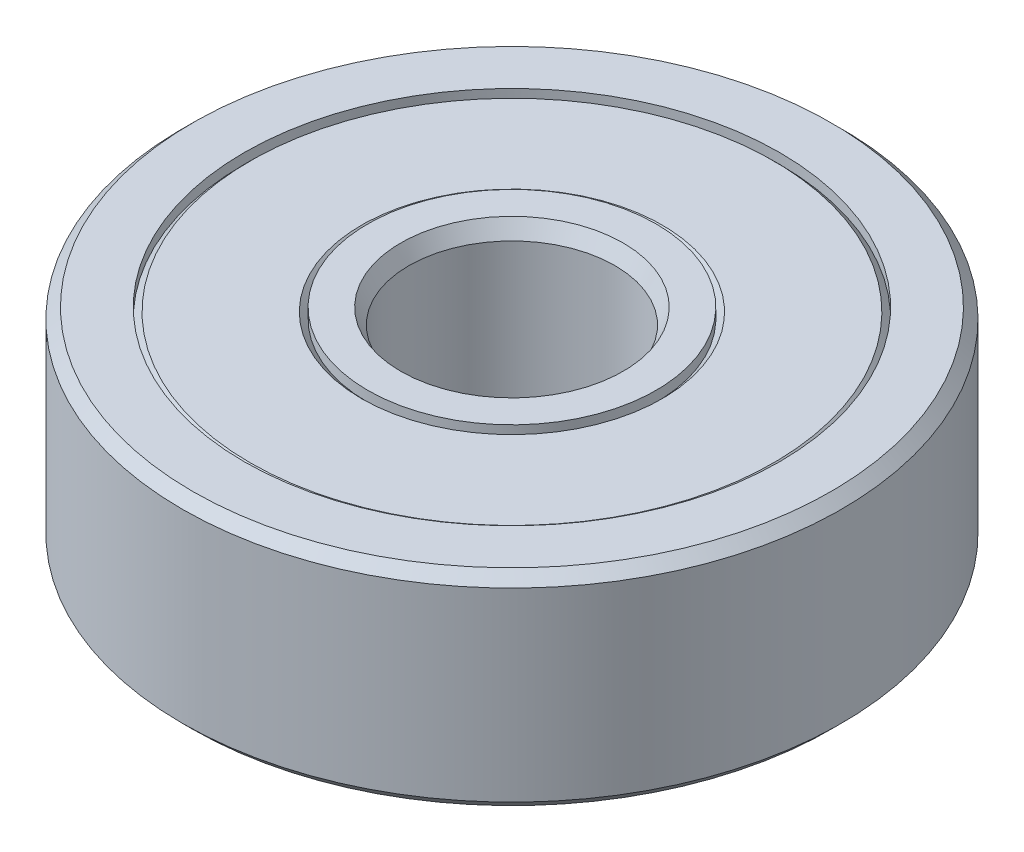
ISO-10303-21;
HEADER;
FILE_DESCRIPTION(('STEP AP214'),'2;1');
FILE_NAME('part.step','',(''),(''),'','','');
FILE_SCHEMA(('AUTOMOTIVE_DESIGN { 1 0 10303 214 1 1 1 1 }'));
ENDSEC;
DATA;
#1=APPLICATION_CONTEXT('core data for automotive mechanical design processes');
#2=APPLICATION_PROTOCOL_DEFINITION('international standard','automotive_design',2000,#1);
#3=PRODUCT_CONTEXT('',#1,'mechanical');
#4=PRODUCT('Part','Part','',(#3));
#5=PRODUCT_RELATED_PRODUCT_CATEGORY('part','',(#4));
#6=PRODUCT_DEFINITION_FORMATION('','',#4);
#7=PRODUCT_DEFINITION_CONTEXT('part definition',#1,'design');
#8=PRODUCT_DEFINITION('design','',#6,#7);
#9=PRODUCT_DEFINITION_SHAPE('','',#8);
#10=(LENGTH_UNIT() NAMED_UNIT(*) SI_UNIT(.MILLI.,.METRE.));
#11=(NAMED_UNIT(*) PLANE_ANGLE_UNIT() SI_UNIT($,.RADIAN.));
#12=(NAMED_UNIT(*) SI_UNIT($,.STERADIAN.) SOLID_ANGLE_UNIT());
#13=UNCERTAINTY_MEASURE_WITH_UNIT(LENGTH_MEASURE(1.E-05),#10,'distance_accuracy_value','');
#14=(GEOMETRIC_REPRESENTATION_CONTEXT(3) GLOBAL_UNCERTAINTY_ASSIGNED_CONTEXT((#13)) GLOBAL_UNIT_ASSIGNED_CONTEXT((#10,
#11,#12)) REPRESENTATION_CONTEXT('',''));
#15=CARTESIAN_POINT('',(0.,0.,0.));
#16=DIRECTION('',(0.,0.,1.));
#17=DIRECTION('',(1.,0.,0.));
#18=AXIS2_PLACEMENT_3D('',#15,#16,#17);
#19=CARTESIAN_POINT('',(0.,4.9,0.));
#20=DIRECTION('',(0.,-1.,0.));
#21=DIRECTION('',(0.,0.,-1.));
#22=AXIS2_PLACEMENT_3D('',#19,#20,#21);
#23=CYLINDRICAL_SURFACE('',#22,3.5);
#24=CARTESIAN_POINT('',(0.,0.250000000000004,0.));
#25=DIRECTION('',(0.,1.,0.));
#26=DIRECTION('',(0.,0.,1.));
#27=AXIS2_PLACEMENT_3D('',#24,#25,#26);
#28=CIRCLE('',#27,3.5);
#29=CARTESIAN_POINT('',(0.,0.250000000000004,3.5));
#30=VERTEX_POINT('',#29);
#31=EDGE_CURVE('E58',#30,#30,#28,.F.);
#32=ORIENTED_EDGE('',*,*,#31,.T.);
#33=EDGE_LOOP('',(#32));
#34=FACE_BOUND('',#33,.T.);
#35=CARTESIAN_POINT('',(0.,4.75,0.));
#36=DIRECTION('',(0.,1.,0.));
#37=DIRECTION('',(0.,0.,1.));
#38=AXIS2_PLACEMENT_3D('',#35,#36,#37);
#39=CIRCLE('',#38,3.5);
#40=CARTESIAN_POINT('',(0.,4.75,3.5));
#41=VERTEX_POINT('',#40);
#42=EDGE_CURVE('E62',#41,#41,#39,.T.);
#43=ORIENTED_EDGE('',*,*,#42,.T.);
#44=EDGE_LOOP('',(#43));
#45=FACE_BOUND('',#44,.T.);
#46=ADVANCED_FACE('F47',(#34,#45),#23,.F.);
#47=CARTESIAN_POINT('',(0.,4.9,0.));
#48=DIRECTION('',(0.,-1.,0.));
#49=DIRECTION('',(0.,0.,-1.));
#50=AXIS2_PLACEMENT_3D('',#47,#48,#49);
#51=CYLINDRICAL_SURFACE('',#50,6.5);
#52=CARTESIAN_POINT('',(0.,0.250000000000003,0.));
#53=DIRECTION('',(0.,1.,0.));
#54=DIRECTION('',(0.,0.,1.));
#55=AXIS2_PLACEMENT_3D('',#52,#53,#54);
#56=CIRCLE('',#55,6.5);
#57=CARTESIAN_POINT('',(0.,0.250000000000003,6.5));
#58=VERTEX_POINT('',#57);
#59=EDGE_CURVE('E73',#58,#58,#56,.T.);
#60=ORIENTED_EDGE('',*,*,#59,.T.);
#61=EDGE_LOOP('',(#60));
#62=FACE_BOUND('',#61,.T.);
#63=CARTESIAN_POINT('',(0.,4.75,0.));
#64=DIRECTION('',(0.,1.,0.));
#65=DIRECTION('',(0.,0.,1.));
#66=AXIS2_PLACEMENT_3D('',#63,#64,#65);
#67=CIRCLE('',#66,6.5);
#68=CARTESIAN_POINT('',(0.,4.75,6.5));
#69=VERTEX_POINT('',#68);
#70=EDGE_CURVE('E76',#69,#69,#67,.F.);
#71=ORIENTED_EDGE('',*,*,#70,.T.);
#72=EDGE_LOOP('',(#71));
#73=FACE_BOUND('',#72,.T.);
#74=ADVANCED_FACE('F80',(#62,#73),#51,.T.);
#75=CARTESIAN_POINT('',(0.,4.9,0.));
#76=DIRECTION('',(0.,1.,0.));
#77=DIRECTION('',(0.,0.,1.));
#78=AXIS2_PLACEMENT_3D('',#75,#76,#77);
#79=PLANE('',#78);
#80=CARTESIAN_POINT('',(0.,4.9,0.));
#81=DIRECTION('',(0.,1.,0.));
#82=DIRECTION('',(0.,0.,1.));
#83=AXIS2_PLACEMENT_3D('',#80,#81,#82);
#84=CIRCLE('',#83,6.35);
#85=CARTESIAN_POINT('',(0.,4.9,6.35));
#86=VERTEX_POINT('',#85);
#87=EDGE_CURVE('E12',#86,#86,#84,.T.);
#88=ORIENTED_EDGE('',*,*,#87,.T.);
#89=EDGE_LOOP('',(#88));
#90=FACE_BOUND('',#89,.T.);
#91=CARTESIAN_POINT('',(0.,4.9,0.));
#92=DIRECTION('',(0.,1.,0.));
#93=DIRECTION('',(0.,0.,1.));
#94=AXIS2_PLACEMENT_3D('',#91,#92,#93);
#95=CIRCLE('',#94,3.65);
#96=CARTESIAN_POINT('',(0.,4.9,3.65));
#97=VERTEX_POINT('',#96);
#98=EDGE_CURVE('E54',#97,#97,#95,.F.);
#99=ORIENTED_EDGE('',*,*,#98,.T.);
#100=EDGE_LOOP('',(#99));
#101=FACE_BOUND('',#100,.T.);
#102=ADVANCED_FACE('F100',(#90,#101),#79,.T.);
#103=CARTESIAN_POINT('',(0.,0.1,0.));
#104=DIRECTION('',(0.,1.,0.));
#105=DIRECTION('',(0.,0.,1.));
#106=AXIS2_PLACEMENT_3D('',#103,#104,#105);
#107=PLANE('',#106);
#108=CARTESIAN_POINT('',(0.,0.1,0.));
#109=DIRECTION('',(0.,1.,0.));
#110=DIRECTION('',(0.,0.,1.));
#111=AXIS2_PLACEMENT_3D('',#108,#109,#110);
#112=CIRCLE('',#111,6.35);
#113=CARTESIAN_POINT('',(0.,0.1,6.35));
#114=VERTEX_POINT('',#113);
#115=EDGE_CURVE('E67',#114,#114,#112,.F.);
#116=ORIENTED_EDGE('',*,*,#115,.T.);
#117=EDGE_LOOP('',(#116));
#118=FACE_BOUND('',#117,.T.);
#119=CARTESIAN_POINT('',(0.,0.1,0.));
#120=DIRECTION('',(0.,1.,0.));
#121=DIRECTION('',(0.,0.,1.));
#122=AXIS2_PLACEMENT_3D('',#119,#120,#121);
#123=CIRCLE('',#122,3.65);
#124=CARTESIAN_POINT('',(0.,0.1,3.65));
#125=VERTEX_POINT('',#124);
#126=EDGE_CURVE('E70',#125,#125,#123,.T.);
#127=ORIENTED_EDGE('',*,*,#126,.T.);
#128=EDGE_LOOP('',(#127));
#129=FACE_BOUND('',#128,.T.);
#130=ADVANCED_FACE('F107',(#118,#129),#107,.F.);
#131=CARTESIAN_POINT('',(0.,0.250000000000003,0.));
#132=DIRECTION('',(0.,1.,0.));
#133=DIRECTION('',(0.,0.,1.));
#134=AXIS2_PLACEMENT_3D('',#131,#132,#133);
#135=CONICAL_SURFACE('',#134,6.5,0.785398163397448);
#136=ORIENTED_EDGE('',*,*,#115,.F.);
#137=EDGE_LOOP('',(#136));
#138=FACE_BOUND('',#137,.T.);
#139=ORIENTED_EDGE('',*,*,#59,.F.);
#140=EDGE_LOOP('',(#139));
#141=FACE_BOUND('',#140,.T.);
#142=ADVANCED_FACE('F91',(#138,#141),#135,.T.);
#143=CARTESIAN_POINT('',(0.,0.1,0.));
#144=DIRECTION('',(0.,-1.,0.));
#145=DIRECTION('',(0.,0.,-1.));
#146=AXIS2_PLACEMENT_3D('',#143,#144,#145);
#147=CONICAL_SURFACE('',#146,3.65,0.785398163397441);
#148=ORIENTED_EDGE('',*,*,#31,.F.);
#149=EDGE_LOOP('',(#148));
#150=FACE_BOUND('',#149,.T.);
#151=ORIENTED_EDGE('',*,*,#126,.F.);
#152=EDGE_LOOP('',(#151));
#153=FACE_BOUND('',#152,.T.);
#154=ADVANCED_FACE('F85',(#150,#153),#147,.F.);
#155=CARTESIAN_POINT('',(0.,4.9,0.));
#156=DIRECTION('',(0.,-1.,0.));
#157=DIRECTION('',(0.,0.,-1.));
#158=AXIS2_PLACEMENT_3D('',#155,#156,#157);
#159=CONICAL_SURFACE('',#158,6.35,0.785398163397451);
#160=ORIENTED_EDGE('',*,*,#70,.F.);
#161=EDGE_LOOP('',(#160));
#162=FACE_BOUND('',#161,.T.);
#163=ORIENTED_EDGE('',*,*,#87,.F.);
#164=EDGE_LOOP('',(#163));
#165=FACE_BOUND('',#164,.T.);
#166=ADVANCED_FACE('F82',(#162,#165),#159,.T.);
#167=CARTESIAN_POINT('',(0.,4.75,0.));
#168=DIRECTION('',(0.,1.,0.));
#169=DIRECTION('',(0.,0.,1.));
#170=AXIS2_PLACEMENT_3D('',#167,#168,#169);
#171=CONICAL_SURFACE('',#170,3.5,0.785398163397448);
#172=ORIENTED_EDGE('',*,*,#98,.F.);
#173=EDGE_LOOP('',(#172));
#174=FACE_BOUND('',#173,.T.);
#175=ORIENTED_EDGE('',*,*,#42,.F.);
#176=EDGE_LOOP('',(#175));
#177=FACE_BOUND('',#176,.T.);
#178=ADVANCED_FACE('F49',(#174,#177),#171,.F.);
#179=CLOSED_SHELL('',(#46,#74,#102,#130,#142,#154,#166,#178));
#180=MANIFOLD_SOLID_BREP('B2',#179);
#181=CARTESIAN_POINT('',(0.,5.,0.));
#182=DIRECTION('',(0.,-1.,0.));
#183=DIRECTION('',(0.,0.,-1.));
#184=AXIS2_PLACEMENT_3D('',#181,#182,#183);
#185=CYLINDRICAL_SURFACE('',#184,6.5);
#186=CARTESIAN_POINT('',(0.,5.,0.));
#187=DIRECTION('',(0.,1.,0.));
#188=DIRECTION('',(0.,0.,1.));
#189=AXIS2_PLACEMENT_3D('',#186,#187,#188);
#190=CIRCLE('',#189,6.5);
#191=CARTESIAN_POINT('',(0.,5.,6.5));
#192=VERTEX_POINT('',#191);
#193=EDGE_CURVE('E195',#192,#192,#190,.T.);
#194=ORIENTED_EDGE('',*,*,#193,.T.);
#195=EDGE_LOOP('',(#194));
#196=FACE_BOUND('',#195,.T.);
#197=CARTESIAN_POINT('',(0.,0.,0.));
#198=DIRECTION('',(0.,1.,0.));
#199=DIRECTION('',(0.,0.,1.));
#200=AXIS2_PLACEMENT_3D('',#197,#198,#199);
#201=CIRCLE('',#200,6.5);
#202=CARTESIAN_POINT('',(0.,0.,6.5));
#203=VERTEX_POINT('',#202);
#204=EDGE_CURVE('E196',#203,#203,#201,.T.);
#205=ORIENTED_EDGE('',*,*,#204,.F.);
#206=EDGE_LOOP('',(#205));
#207=FACE_BOUND('',#206,.T.);
#208=ADVANCED_FACE('F175',(#196,#207),#185,.F.);
#209=CARTESIAN_POINT('',(0.,5.,0.));
#210=DIRECTION('',(0.,-1.,0.));
#211=DIRECTION('',(0.,0.,-1.));
#212=AXIS2_PLACEMENT_3D('',#209,#210,#211);
#213=CYLINDRICAL_SURFACE('',#212,8.);
#214=CARTESIAN_POINT('',(0.,0.250000000000002,0.));
#215=DIRECTION('',(0.,1.,0.));
#216=DIRECTION('',(0.,0.,1.));
#217=AXIS2_PLACEMENT_3D('',#214,#215,#216);
#218=CIRCLE('',#217,8.);
#219=CARTESIAN_POINT('',(0.,0.250000000000002,8.));
#220=VERTEX_POINT('',#219);
#221=EDGE_CURVE('E186',#220,#220,#218,.T.);
#222=ORIENTED_EDGE('',*,*,#221,.T.);
#223=EDGE_LOOP('',(#222));
#224=FACE_BOUND('',#223,.T.);
#225=CARTESIAN_POINT('',(0.,4.75,0.));
#226=DIRECTION('',(0.,1.,0.));
#227=DIRECTION('',(0.,0.,1.));
#228=AXIS2_PLACEMENT_3D('',#225,#226,#227);
#229=CIRCLE('',#228,8.);
#230=CARTESIAN_POINT('',(0.,4.75,8.));
#231=VERTEX_POINT('',#230);
#232=EDGE_CURVE('E190',#231,#231,#229,.F.);
#233=ORIENTED_EDGE('',*,*,#232,.T.);
#234=EDGE_LOOP('',(#233));
#235=FACE_BOUND('',#234,.T.);
#236=ADVANCED_FACE('F207',(#224,#235),#213,.T.);
#237=CARTESIAN_POINT('',(0.,5.,0.));
#238=DIRECTION('',(0.,1.,0.));
#239=DIRECTION('',(0.,0.,1.));
#240=AXIS2_PLACEMENT_3D('',#237,#238,#239);
#241=PLANE('',#240);
#242=CARTESIAN_POINT('',(0.,5.,0.));
#243=DIRECTION('',(0.,1.,0.));
#244=DIRECTION('',(0.,0.,1.));
#245=AXIS2_PLACEMENT_3D('',#242,#243,#244);
#246=CIRCLE('',#245,7.75);
#247=CARTESIAN_POINT('',(0.,5.,7.75));
#248=VERTEX_POINT('',#247);
#249=EDGE_CURVE('E46',#248,#248,#246,.T.);
#250=ORIENTED_EDGE('',*,*,#249,.T.);
#251=EDGE_LOOP('',(#250));
#252=FACE_BOUND('',#251,.T.);
#253=ORIENTED_EDGE('',*,*,#193,.F.);
#254=EDGE_LOOP('',(#253));
#255=FACE_BOUND('',#254,.T.);
#256=ADVANCED_FACE('F204',(#252,#255),#241,.T.);
#257=CARTESIAN_POINT('',(0.,0.,0.));
#258=DIRECTION('',(0.,1.,0.));
#259=DIRECTION('',(0.,0.,1.));
#260=AXIS2_PLACEMENT_3D('',#257,#258,#259);
#261=PLANE('',#260);
#262=CARTESIAN_POINT('',(0.,0.,0.));
#263=DIRECTION('',(0.,1.,0.));
#264=DIRECTION('',(0.,0.,1.));
#265=AXIS2_PLACEMENT_3D('',#262,#263,#264);
#266=CIRCLE('',#265,7.75);
#267=CARTESIAN_POINT('',(0.,0.,7.75));
#268=VERTEX_POINT('',#267);
#269=EDGE_CURVE('E182',#268,#268,#266,.F.);
#270=ORIENTED_EDGE('',*,*,#269,.T.);
#271=EDGE_LOOP('',(#270));
#272=FACE_BOUND('',#271,.T.);
#273=ORIENTED_EDGE('',*,*,#204,.T.);
#274=EDGE_LOOP('',(#273));
#275=FACE_BOUND('',#274,.T.);
#276=ADVANCED_FACE('F206',(#272,#275),#261,.F.);
#277=CARTESIAN_POINT('',(0.,0.250000000000002,0.));
#278=DIRECTION('',(0.,1.,0.));
#279=DIRECTION('',(0.,0.,1.));
#280=AXIS2_PLACEMENT_3D('',#277,#278,#279);
#281=CONICAL_SURFACE('',#280,8.,0.785398163397448);
#282=ORIENTED_EDGE('',*,*,#269,.F.);
#283=EDGE_LOOP('',(#282));
#284=FACE_BOUND('',#283,.T.);
#285=ORIENTED_EDGE('',*,*,#221,.F.);
#286=EDGE_LOOP('',(#285));
#287=FACE_BOUND('',#286,.T.);
#288=ADVANCED_FACE('F213',(#284,#287),#281,.T.);
#289=CARTESIAN_POINT('',(0.,5.,0.));
#290=DIRECTION('',(0.,-1.,0.));
#291=DIRECTION('',(0.,0.,-1.));
#292=AXIS2_PLACEMENT_3D('',#289,#290,#291);
#293=CONICAL_SURFACE('',#292,7.75,0.785398163397441);
#294=ORIENTED_EDGE('',*,*,#232,.F.);
#295=EDGE_LOOP('',(#294));
#296=FACE_BOUND('',#295,.T.);
#297=ORIENTED_EDGE('',*,*,#249,.F.);
#298=EDGE_LOOP('',(#297));
#299=FACE_BOUND('',#298,.T.);
#300=ADVANCED_FACE('F177',(#296,#299),#293,.T.);
#301=CLOSED_SHELL('',(#208,#236,#256,#276,#288,#300));
#302=MANIFOLD_SOLID_BREP('B7',#301);
#303=CARTESIAN_POINT('',(0.,5.,0.));
#304=DIRECTION('',(0.,-1.,0.));
#305=DIRECTION('',(0.,0.,-1.));
#306=AXIS2_PLACEMENT_3D('',#303,#304,#305);
#307=CYLINDRICAL_SURFACE('',#306,2.5);
#308=CARTESIAN_POINT('',(0.,0.376145293069265,0.));
#309=DIRECTION('',(0.,1.,0.));
#310=DIRECTION('',(0.,0.,1.));
#311=AXIS2_PLACEMENT_3D('',#308,#309,#310);
#312=CIRCLE('',#311,2.5);
#313=CARTESIAN_POINT('',(0.,0.376145293069265,2.5));
#314=VERTEX_POINT('',#313);
#315=EDGE_CURVE('E174',#314,#314,#312,.F.);
#316=ORIENTED_EDGE('',*,*,#315,.T.);
#317=EDGE_LOOP('',(#316));
#318=FACE_BOUND('',#317,.T.);
#319=CARTESIAN_POINT('',(0.,4.62385470693073,0.));
#320=DIRECTION('',(0.,1.,0.));
#321=DIRECTION('',(0.,0.,1.));
#322=AXIS2_PLACEMENT_3D('',#319,#320,#321);
#323=CIRCLE('',#322,2.5);
#324=CARTESIAN_POINT('',(0.,4.62385470693073,2.5));
#325=VERTEX_POINT('',#324);
#326=EDGE_CURVE('E281',#325,#325,#323,.T.);
#327=ORIENTED_EDGE('',*,*,#326,.T.);
#328=EDGE_LOOP('',(#327));
#329=FACE_BOUND('',#328,.T.);
#330=ADVANCED_FACE('F266',(#318,#329),#307,.F.);
#331=CARTESIAN_POINT('',(0.,5.,0.));
#332=DIRECTION('',(0.,-1.,0.));
#333=DIRECTION('',(0.,0.,-1.));
#334=AXIS2_PLACEMENT_3D('',#331,#332,#333);
#335=CYLINDRICAL_SURFACE('',#334,3.5);
#336=CARTESIAN_POINT('',(0.,5.,0.));
#337=DIRECTION('',(0.,1.,0.));
#338=DIRECTION('',(0.,0.,1.));
#339=AXIS2_PLACEMENT_3D('',#336,#337,#338);
#340=CIRCLE('',#339,3.5);
#341=CARTESIAN_POINT('',(0.,5.,3.5));
#342=VERTEX_POINT('',#341);
#343=EDGE_CURVE('E286',#342,#342,#340,.T.);
#344=ORIENTED_EDGE('',*,*,#343,.F.);
#345=EDGE_LOOP('',(#344));
#346=FACE_BOUND('',#345,.T.);
#347=CARTESIAN_POINT('',(0.,0.,0.));
#348=DIRECTION('',(0.,1.,0.));
#349=DIRECTION('',(0.,0.,1.));
#350=AXIS2_PLACEMENT_3D('',#347,#348,#349);
#351=CIRCLE('',#350,3.5);
#352=CARTESIAN_POINT('',(0.,0.,3.5));
#353=VERTEX_POINT('',#352);
#354=EDGE_CURVE('E287',#353,#353,#351,.T.);
#355=ORIENTED_EDGE('',*,*,#354,.T.);
#356=EDGE_LOOP('',(#355));
#357=FACE_BOUND('',#356,.T.);
#358=ADVANCED_FACE('F295',(#346,#357),#335,.T.);
#359=CARTESIAN_POINT('',(0.,5.,0.));
#360=DIRECTION('',(0.,1.,0.));
#361=DIRECTION('',(0.,0.,1.));
#362=AXIS2_PLACEMENT_3D('',#359,#360,#361);
#363=PLANE('',#362);
#364=CARTESIAN_POINT('',(0.,5.,0.));
#365=DIRECTION('',(0.,1.,0.));
#366=DIRECTION('',(0.,0.,1.));
#367=AXIS2_PLACEMENT_3D('',#364,#365,#366);
#368=CIRCLE('',#367,2.7);
#369=CARTESIAN_POINT('',(0.,5.,2.7));
#370=VERTEX_POINT('',#369);
#371=EDGE_CURVE('E277',#370,#370,#368,.F.);
#372=ORIENTED_EDGE('',*,*,#371,.T.);
#373=EDGE_LOOP('',(#372));
#374=FACE_BOUND('',#373,.T.);
#375=ORIENTED_EDGE('',*,*,#343,.T.);
#376=EDGE_LOOP('',(#375));
#377=FACE_BOUND('',#376,.T.);
#378=ADVANCED_FACE('F293',(#374,#377),#363,.T.);
#379=CARTESIAN_POINT('',(0.,0.,0.));
#380=DIRECTION('',(0.,1.,0.));
#381=DIRECTION('',(0.,0.,1.));
#382=AXIS2_PLACEMENT_3D('',#379,#380,#381);
#383=PLANE('',#382);
#384=CARTESIAN_POINT('',(0.,0.,0.));
#385=DIRECTION('',(0.,1.,0.));
#386=DIRECTION('',(0.,0.,1.));
#387=AXIS2_PLACEMENT_3D('',#384,#385,#386);
#388=CIRCLE('',#387,2.7);
#389=CARTESIAN_POINT('',(0.,0.,2.7));
#390=VERTEX_POINT('',#389);
#391=EDGE_CURVE('E273',#390,#390,#388,.T.);
#392=ORIENTED_EDGE('',*,*,#391,.T.);
#393=EDGE_LOOP('',(#392));
#394=FACE_BOUND('',#393,.T.);
#395=ORIENTED_EDGE('',*,*,#354,.F.);
#396=EDGE_LOOP('',(#395));
#397=FACE_BOUND('',#396,.T.);
#398=ADVANCED_FACE('F301',(#394,#397),#383,.F.);
#399=CARTESIAN_POINT('',(0.,4.62385470693073,0.));
#400=DIRECTION('',(0.,1.,0.));
#401=DIRECTION('',(0.,0.,1.));
#402=AXIS2_PLACEMENT_3D('',#399,#400,#401);
#403=CONICAL_SURFACE('',#402,2.5,0.488692190558414);
#404=ORIENTED_EDGE('',*,*,#371,.F.);
#405=EDGE_LOOP('',(#404));
#406=FACE_BOUND('',#405,.T.);
#407=ORIENTED_EDGE('',*,*,#326,.F.);
#408=EDGE_LOOP('',(#407));
#409=FACE_BOUND('',#408,.T.);
#410=ADVANCED_FACE('F303',(#406,#409),#403,.F.);
#411=CARTESIAN_POINT('',(0.,0.,0.));
#412=DIRECTION('',(0.,-1.,0.));
#413=DIRECTION('',(0.,0.,-1.));
#414=AXIS2_PLACEMENT_3D('',#411,#412,#413);
#415=CONICAL_SURFACE('',#414,2.7,0.488692190558414);
#416=ORIENTED_EDGE('',*,*,#315,.F.);
#417=EDGE_LOOP('',(#416));
#418=FACE_BOUND('',#417,.T.);
#419=ORIENTED_EDGE('',*,*,#391,.F.);
#420=EDGE_LOOP('',(#419));
#421=FACE_BOUND('',#420,.T.);
#422=ADVANCED_FACE('F268',(#418,#421),#415,.F.);
#423=CLOSED_SHELL('',(#330,#358,#378,#398,#410,#422));
#424=MANIFOLD_SOLID_BREP('B41',#423);
#425=ADVANCED_BREP_SHAPE_REPRESENTATION('',(#18,#180,#302,#424),#14);
#426=SHAPE_DEFINITION_REPRESENTATION(#9,#425);
ENDSEC;
END-ISO-10303-21;
